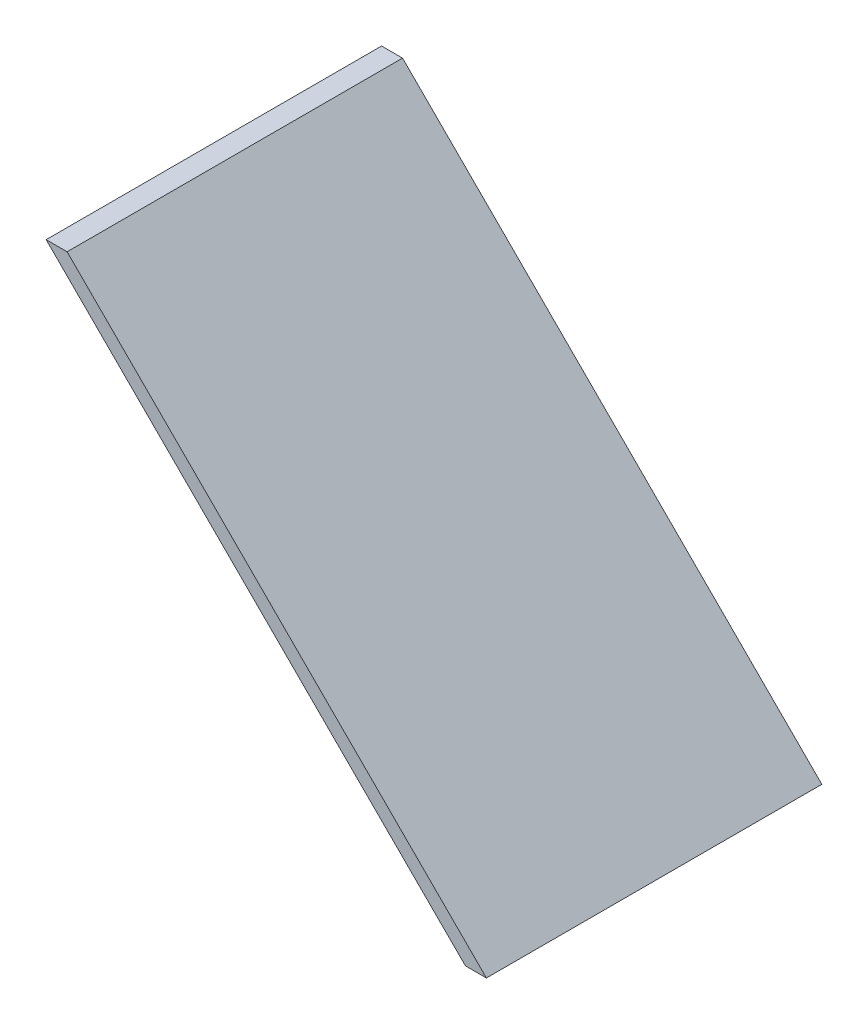
ISO-10303-21;
HEADER;
FILE_DESCRIPTION(('STEP AP214'),'2;1');
FILE_NAME('part.step','',(''),(''),'','','');
FILE_SCHEMA(('AUTOMOTIVE_DESIGN { 1 0 10303 214 1 1 1 1 }'));
ENDSEC;
DATA;
#1=APPLICATION_CONTEXT('core data for automotive mechanical design processes');
#2=APPLICATION_PROTOCOL_DEFINITION('international standard','automotive_design',2000,#1);
#3=PRODUCT_CONTEXT('',#1,'mechanical');
#4=PRODUCT('Part','Part','',(#3));
#5=PRODUCT_RELATED_PRODUCT_CATEGORY('part','',(#4));
#6=PRODUCT_DEFINITION_FORMATION('','',#4);
#7=PRODUCT_DEFINITION_CONTEXT('part definition',#1,'design');
#8=PRODUCT_DEFINITION('design','',#6,#7);
#9=PRODUCT_DEFINITION_SHAPE('','',#8);
#10=(LENGTH_UNIT() NAMED_UNIT(*) SI_UNIT(.MILLI.,.METRE.));
#11=(NAMED_UNIT(*) PLANE_ANGLE_UNIT() SI_UNIT($,.RADIAN.));
#12=(NAMED_UNIT(*) SI_UNIT($,.STERADIAN.) SOLID_ANGLE_UNIT());
#13=UNCERTAINTY_MEASURE_WITH_UNIT(LENGTH_MEASURE(1.E-05),#10,'distance_accuracy_value','');
#14=(GEOMETRIC_REPRESENTATION_CONTEXT(3) GLOBAL_UNCERTAINTY_ASSIGNED_CONTEXT((#13)) GLOBAL_UNIT_ASSIGNED_CONTEXT((#10,
#11,#12)) REPRESENTATION_CONTEXT('',''));
#15=CARTESIAN_POINT('',(0.,0.,0.));
#16=DIRECTION('',(0.,0.,1.));
#17=DIRECTION('',(1.,0.,0.));
#18=AXIS2_PLACEMENT_3D('',#15,#16,#17);
#19=CARTESIAN_POINT('',(0.,100.,80.));
#20=DIRECTION('',(0.,-1.,0.));
#21=DIRECTION('',(0.,0.,-1.));
#22=AXIS2_PLACEMENT_3D('',#19,#20,#21);
#23=PLANE('',#22);
#24=DIRECTION('',(-1.,0.,0.));
#25=VECTOR('',#24,1.);
#26=CARTESIAN_POINT('',(0.,100.,0.));
#27=LINE('',#26,#25);
#28=CARTESIAN_POINT('',(5.,100.,0.));
#29=VERTEX_POINT('',#28);
#30=CARTESIAN_POINT('',(0.,100.,0.));
#31=VERTEX_POINT('',#30);
#32=EDGE_CURVE('E96',#29,#31,#27,.T.);
#33=ORIENTED_EDGE('',*,*,#32,.T.);
#34=DIRECTION('',(0.,0.,-1.));
#35=VECTOR('',#34,1.);
#36=CARTESIAN_POINT('',(0.,100.,80.));
#37=LINE('',#36,#35);
#38=CARTESIAN_POINT('',(0.,100.,80.));
#39=VERTEX_POINT('',#38);
#40=EDGE_CURVE('E11',#39,#31,#37,.T.);
#41=ORIENTED_EDGE('',*,*,#40,.F.);
#42=DIRECTION('',(-1.,0.,0.));
#43=VECTOR('',#42,1.);
#44=CARTESIAN_POINT('',(0.,100.,80.));
#45=LINE('',#44,#43);
#46=CARTESIAN_POINT('',(5.,100.,80.));
#47=VERTEX_POINT('',#46);
#48=EDGE_CURVE('E84',#47,#39,#45,.T.);
#49=ORIENTED_EDGE('',*,*,#48,.F.);
#50=DIRECTION('',(0.,0.,-1.));
#51=VECTOR('',#50,1.);
#52=CARTESIAN_POINT('',(5.,100.,80.));
#53=LINE('',#52,#51);
#54=EDGE_CURVE('E92',#47,#29,#53,.T.);
#55=ORIENTED_EDGE('',*,*,#54,.T.);
#56=EDGE_LOOP('',(#33,#41,#49,#55));
#57=FACE_BOUND('',#56,.T.);
#58=ADVANCED_FACE('F33',(#57),#23,.F.);
#59=CARTESIAN_POINT('',(0.,100.,80.));
#60=DIRECTION('',(0.707106781186548,0.707106781186547,0.));
#61=DIRECTION('',(-0.707106781186547,0.707106781186548,0.));
#62=AXIS2_PLACEMENT_3D('',#59,#60,#61);
#63=PLANE('',#62);
#64=DIRECTION('',(0.707106781186547,-0.707106781186548,0.));
#65=VECTOR('',#64,1.);
#66=CARTESIAN_POINT('',(0.,100.,0.));
#67=LINE('',#66,#65);
#68=CARTESIAN_POINT('',(100.,0.,0.));
#69=VERTEX_POINT('',#68);
#70=EDGE_CURVE('E88',#31,#69,#67,.T.);
#71=ORIENTED_EDGE('',*,*,#70,.T.);
#72=DIRECTION('',(0.,0.,-1.));
#73=VECTOR('',#72,1.);
#74=CARTESIAN_POINT('',(100.,0.,80.));
#75=LINE('',#74,#73);
#76=CARTESIAN_POINT('',(100.,0.,80.));
#77=VERTEX_POINT('',#76);
#78=EDGE_CURVE('E41',#77,#69,#75,.T.);
#79=ORIENTED_EDGE('',*,*,#78,.F.);
#80=DIRECTION('',(0.707106781186547,-0.707106781186548,0.));
#81=VECTOR('',#80,1.);
#82=CARTESIAN_POINT('',(0.,100.,80.));
#83=LINE('',#82,#81);
#84=EDGE_CURVE('E79',#39,#77,#83,.T.);
#85=ORIENTED_EDGE('',*,*,#84,.F.);
#86=ORIENTED_EDGE('',*,*,#40,.T.);
#87=EDGE_LOOP('',(#71,#79,#85,#86));
#88=FACE_BOUND('',#87,.T.);
#89=ADVANCED_FACE('F87',(#88),#63,.F.);
#90=CARTESIAN_POINT('',(100.,0.,80.));
#91=DIRECTION('',(0.,1.,0.));
#92=DIRECTION('',(0.,0.,1.));
#93=AXIS2_PLACEMENT_3D('',#90,#91,#92);
#94=PLANE('',#93);
#95=DIRECTION('',(1.,0.,0.));
#96=VECTOR('',#95,1.);
#97=CARTESIAN_POINT('',(100.,0.,0.));
#98=LINE('',#97,#96);
#99=CARTESIAN_POINT('',(105.,0.,0.));
#100=VERTEX_POINT('',#99);
#101=EDGE_CURVE('E66',#69,#100,#98,.T.);
#102=ORIENTED_EDGE('',*,*,#101,.T.);
#103=DIRECTION('',(0.,0.,-1.));
#104=VECTOR('',#103,1.);
#105=CARTESIAN_POINT('',(105.,0.,80.));
#106=LINE('',#105,#104);
#107=CARTESIAN_POINT('',(105.,0.,80.));
#108=VERTEX_POINT('',#107);
#109=EDGE_CURVE('E89',#108,#100,#106,.T.);
#110=ORIENTED_EDGE('',*,*,#109,.F.);
#111=DIRECTION('',(1.,0.,0.));
#112=VECTOR('',#111,1.);
#113=CARTESIAN_POINT('',(100.,0.,80.));
#114=LINE('',#113,#112);
#115=EDGE_CURVE('E82',#77,#108,#114,.T.);
#116=ORIENTED_EDGE('',*,*,#115,.F.);
#117=ORIENTED_EDGE('',*,*,#78,.T.);
#118=EDGE_LOOP('',(#102,#110,#116,#117));
#119=FACE_BOUND('',#118,.T.);
#120=ADVANCED_FACE('F90',(#119),#94,.F.);
#121=CARTESIAN_POINT('',(105.,0.,80.));
#122=DIRECTION('',(-0.707106781186548,-0.707106781186547,0.));
#123=DIRECTION('',(0.707106781186547,-0.707106781186548,0.));
#124=AXIS2_PLACEMENT_3D('',#121,#122,#123);
#125=PLANE('',#124);
#126=DIRECTION('',(-0.707106781186547,0.707106781186548,0.));
#127=VECTOR('',#126,1.);
#128=CARTESIAN_POINT('',(105.,0.,0.));
#129=LINE('',#128,#127);
#130=EDGE_CURVE('E72',#100,#29,#129,.T.);
#131=ORIENTED_EDGE('',*,*,#130,.T.);
#132=ORIENTED_EDGE('',*,*,#54,.F.);
#133=DIRECTION('',(-0.707106781186547,0.707106781186548,0.));
#134=VECTOR('',#133,1.);
#135=CARTESIAN_POINT('',(105.,0.,80.));
#136=LINE('',#135,#134);
#137=EDGE_CURVE('E49',#108,#47,#136,.T.);
#138=ORIENTED_EDGE('',*,*,#137,.F.);
#139=ORIENTED_EDGE('',*,*,#109,.T.);
#140=EDGE_LOOP('',(#131,#132,#138,#139));
#141=FACE_BOUND('',#140,.T.);
#142=ADVANCED_FACE('F103',(#141),#125,.F.);
#143=CARTESIAN_POINT('',(0.,0.,80.));
#144=DIRECTION('',(0.,0.,1.));
#145=DIRECTION('',(1.,0.,0.));
#146=AXIS2_PLACEMENT_3D('',#143,#144,#145);
#147=PLANE('',#146);
#148=ORIENTED_EDGE('',*,*,#48,.T.);
#149=ORIENTED_EDGE('',*,*,#84,.T.);
#150=ORIENTED_EDGE('',*,*,#115,.T.);
#151=ORIENTED_EDGE('',*,*,#137,.T.);
#152=EDGE_LOOP('',(#148,#149,#150,#151));
#153=FACE_BOUND('',#152,.T.);
#154=ADVANCED_FACE('F80',(#153),#147,.T.);
#155=CARTESIAN_POINT('',(0.,0.,0.));
#156=DIRECTION('',(0.,0.,1.));
#157=DIRECTION('',(1.,0.,0.));
#158=AXIS2_PLACEMENT_3D('',#155,#156,#157);
#159=PLANE('',#158);
#160=ORIENTED_EDGE('',*,*,#32,.F.);
#161=ORIENTED_EDGE('',*,*,#130,.F.);
#162=ORIENTED_EDGE('',*,*,#101,.F.);
#163=ORIENTED_EDGE('',*,*,#70,.F.);
#164=EDGE_LOOP('',(#160,#161,#162,#163));
#165=FACE_BOUND('',#164,.T.);
#166=ADVANCED_FACE('F106',(#165),#159,.F.);
#167=CLOSED_SHELL('',(#58,#89,#120,#142,#154,#166));
#168=MANIFOLD_SOLID_BREP('B2',#167);
#169=ADVANCED_BREP_SHAPE_REPRESENTATION('',(#18,#168),#14);
#170=SHAPE_DEFINITION_REPRESENTATION(#9,#169);
ENDSEC;
END-ISO-10303-21;
